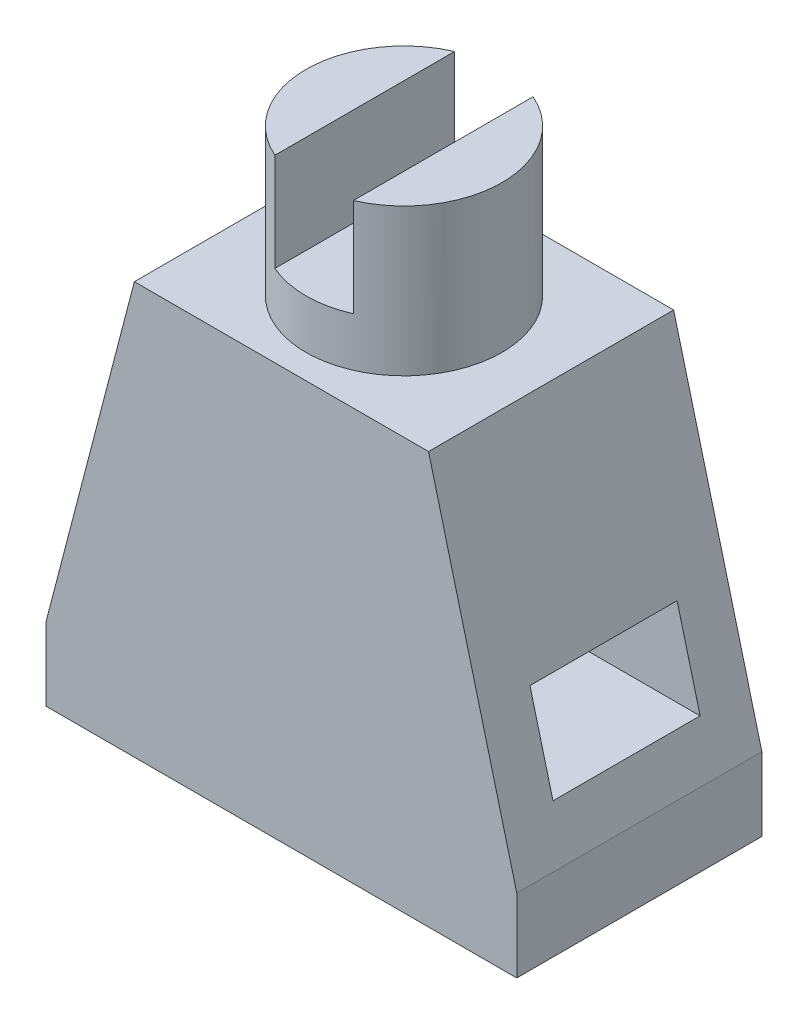
ISO-10303-21;
HEADER;
FILE_DESCRIPTION(('STEP AP214'),'2;1');
FILE_NAME('part.step','',(''),(''),'','','');
FILE_SCHEMA(('AUTOMOTIVE_DESIGN { 1 0 10303 214 1 1 1 1 }'));
ENDSEC;
DATA;
#1=APPLICATION_CONTEXT('core data for automotive mechanical design processes');
#2=APPLICATION_PROTOCOL_DEFINITION('international standard','automotive_design',2000,#1);
#3=PRODUCT_CONTEXT('',#1,'mechanical');
#4=PRODUCT('Part','Part','',(#3));
#5=PRODUCT_RELATED_PRODUCT_CATEGORY('part','',(#4));
#6=PRODUCT_DEFINITION_FORMATION('','',#4);
#7=PRODUCT_DEFINITION_CONTEXT('part definition',#1,'design');
#8=PRODUCT_DEFINITION('design','',#6,#7);
#9=PRODUCT_DEFINITION_SHAPE('','',#8);
#10=(LENGTH_UNIT() NAMED_UNIT(*) SI_UNIT(.MILLI.,.METRE.));
#11=(NAMED_UNIT(*) PLANE_ANGLE_UNIT() SI_UNIT($,.RADIAN.));
#12=(NAMED_UNIT(*) SI_UNIT($,.STERADIAN.) SOLID_ANGLE_UNIT());
#13=UNCERTAINTY_MEASURE_WITH_UNIT(LENGTH_MEASURE(1.E-05),#10,'distance_accuracy_value','');
#14=(GEOMETRIC_REPRESENTATION_CONTEXT(3) GLOBAL_UNCERTAINTY_ASSIGNED_CONTEXT((#13)) GLOBAL_UNIT_ASSIGNED_CONTEXT((#10,
#11,#12)) REPRESENTATION_CONTEXT('',''));
#15=CARTESIAN_POINT('',(0.,0.,0.));
#16=DIRECTION('',(0.,0.,1.));
#17=DIRECTION('',(1.,0.,0.));
#18=AXIS2_PLACEMENT_3D('',#15,#16,#17);
#19=CARTESIAN_POINT('',(48.,114.,-25.));
#20=DIRECTION('',(0.,1.,0.));
#21=DIRECTION('',(0.,0.,1.));
#22=AXIS2_PLACEMENT_3D('',#19,#20,#21);
#23=PLANE('',#22);
#24=DIRECTION('',(0.,0.,1.));
#25=VECTOR('',#24,1.);
#26=CARTESIAN_POINT('',(40.,114.,-6.66969722017663));
#27=LINE('',#26,#25);
#28=CARTESIAN_POINT('',(40.,114.,-43.3303027798234));
#29=VERTEX_POINT('',#28);
#30=CARTESIAN_POINT('',(40.,114.,-6.66969722017663));
#31=VERTEX_POINT('',#30);
#32=EDGE_CURVE('E149',#29,#31,#27,.T.);
#33=ORIENTED_EDGE('',*,*,#32,.F.);
#34=CARTESIAN_POINT('',(48.,114.,-25.));
#35=DIRECTION('',(0.,1.,0.));
#36=DIRECTION('',(0.,0.,1.));
#37=AXIS2_PLACEMENT_3D('',#34,#35,#36);
#38=CIRCLE('',#37,20.);
#39=EDGE_CURVE('E165',#29,#31,#38,.T.);
#40=ORIENTED_EDGE('',*,*,#39,.T.);
#41=EDGE_LOOP('',(#33,#40));
#42=FACE_BOUND('',#41,.T.);
#43=ADVANCED_FACE('F33',(#42),#23,.T.);
#44=CARTESIAN_POINT('',(0.,84.,0.));
#45=DIRECTION('',(0.,-1.,0.));
#46=DIRECTION('',(0.,0.,-1.));
#47=AXIS2_PLACEMENT_3D('',#44,#45,#46);
#48=PLANE('',#47);
#49=DIRECTION('',(1.,0.,0.));
#50=VECTOR('',#49,1.);
#51=CARTESIAN_POINT('',(0.,84.,0.));
#52=LINE('',#51,#50);
#53=CARTESIAN_POINT('',(18.,84.,0.));
#54=VERTEX_POINT('',#53);
#55=CARTESIAN_POINT('',(78.,84.,0.));
#56=VERTEX_POINT('',#55);
#57=EDGE_CURVE('E212',#54,#56,#52,.T.);
#58=ORIENTED_EDGE('',*,*,#57,.T.);
#59=DIRECTION('',(0.,0.,-1.));
#60=VECTOR('',#59,1.);
#61=CARTESIAN_POINT('',(78.,84.,233.76368558454));
#62=LINE('',#61,#60);
#63=CARTESIAN_POINT('',(78.,84.,-50.));
#64=VERTEX_POINT('',#63);
#65=EDGE_CURVE('E164',#56,#64,#62,.T.);
#66=ORIENTED_EDGE('',*,*,#65,.T.);
#67=DIRECTION('',(-1.,0.,0.));
#68=VECTOR('',#67,1.);
#69=CARTESIAN_POINT('',(0.,84.,-50.));
#70=LINE('',#69,#68);
#71=CARTESIAN_POINT('',(18.,84.,-50.));
#72=VERTEX_POINT('',#71);
#73=EDGE_CURVE('E215',#64,#72,#70,.T.);
#74=ORIENTED_EDGE('',*,*,#73,.T.);
#75=DIRECTION('',(0.,0.,-1.));
#76=VECTOR('',#75,1.);
#77=CARTESIAN_POINT('',(18.,84.,171.26368558454));
#78=LINE('',#77,#76);
#79=EDGE_CURVE('E184',#54,#72,#78,.T.);
#80=ORIENTED_EDGE('',*,*,#79,.F.);
#81=EDGE_LOOP('',(#58,#66,#74,#80));
#82=FACE_BOUND('',#81,.T.);
#83=CARTESIAN_POINT('',(48.,84.,-25.));
#84=DIRECTION('',(0.,-1.,0.));
#85=DIRECTION('',(0.,0.,-1.));
#86=AXIS2_PLACEMENT_3D('',#83,#84,#85);
#87=CIRCLE('',#86,20.);
#88=CARTESIAN_POINT('',(48.,84.,-45.));
#89=VERTEX_POINT('',#88);
#90=EDGE_CURVE('E11',#89,#89,#87,.F.);
#91=ORIENTED_EDGE('',*,*,#90,.F.);
#92=EDGE_LOOP('',(#91));
#93=FACE_BOUND('',#92,.T.);
#94=ADVANCED_FACE('F261',(#82,#93),#48,.F.);
#95=CARTESIAN_POINT('',(0.,84.,0.));
#96=DIRECTION('',(1.,0.,0.));
#97=DIRECTION('',(0.,0.,-1.));
#98=AXIS2_PLACEMENT_3D('',#95,#96,#97);
#99=PLANE('',#98);
#100=DIRECTION('',(0.,0.,-1.));
#101=VECTOR('',#100,1.);
#102=CARTESIAN_POINT('',(0.,15.,171.26368558454));
#103=LINE('',#102,#101);
#104=CARTESIAN_POINT('',(0.,15.,0.));
#105=VERTEX_POINT('',#104);
#106=CARTESIAN_POINT('',(0.,15.,-50.));
#107=VERTEX_POINT('',#106);
#108=EDGE_CURVE('E183',#105,#107,#103,.T.);
#109=ORIENTED_EDGE('',*,*,#108,.T.);
#110=DIRECTION('',(0.,-1.,0.));
#111=VECTOR('',#110,1.);
#112=CARTESIAN_POINT('',(0.,84.,-50.));
#113=LINE('',#112,#111);
#114=CARTESIAN_POINT('',(0.,0.,-50.));
#115=VERTEX_POINT('',#114);
#116=EDGE_CURVE('E218',#107,#115,#113,.T.);
#117=ORIENTED_EDGE('',*,*,#116,.T.);
#118=DIRECTION('',(0.,0.,1.));
#119=VECTOR('',#118,1.);
#120=CARTESIAN_POINT('',(0.,0.,0.));
#121=LINE('',#120,#119);
#122=CARTESIAN_POINT('',(0.,0.,0.));
#123=VERTEX_POINT('',#122);
#124=EDGE_CURVE('E206',#115,#123,#121,.T.);
#125=ORIENTED_EDGE('',*,*,#124,.T.);
#126=DIRECTION('',(0.,-1.,0.));
#127=VECTOR('',#126,1.);
#128=CARTESIAN_POINT('',(0.,84.,0.));
#129=LINE('',#128,#127);
#130=EDGE_CURVE('E234',#105,#123,#129,.T.);
#131=ORIENTED_EDGE('',*,*,#130,.F.);
#132=EDGE_LOOP('',(#109,#117,#125,#131));
#133=FACE_BOUND('',#132,.T.);
#134=ADVANCED_FACE('F35',(#133),#99,.F.);
#135=CARTESIAN_POINT('',(0.,84.,0.));
#136=DIRECTION('',(0.,0.,-1.));
#137=DIRECTION('',(-1.,0.,0.));
#138=AXIS2_PLACEMENT_3D('',#135,#136,#137);
#139=PLANE('',#138);
#140=DIRECTION('',(0.,-1.,0.));
#141=VECTOR('',#140,1.);
#142=CARTESIAN_POINT('',(96.,84.,0.));
#143=LINE('',#142,#141);
#144=CARTESIAN_POINT('',(96.,15.,0.));
#145=VERTEX_POINT('',#144);
#146=CARTESIAN_POINT('',(96.,0.,0.));
#147=VERTEX_POINT('',#146);
#148=EDGE_CURVE('E232',#145,#147,#143,.T.);
#149=ORIENTED_EDGE('',*,*,#148,.F.);
#150=DIRECTION('',(-0.252421897147003,0.967617272396844,0.));
#151=VECTOR('',#150,1.);
#152=CARTESIAN_POINT('',(73.0300884955752,103.051327433628,0.));
#153=LINE('',#152,#151);
#154=EDGE_CURVE('E180',#145,#56,#153,.T.);
#155=ORIENTED_EDGE('',*,*,#154,.T.);
#156=ORIENTED_EDGE('',*,*,#57,.F.);
#157=DIRECTION('',(0.252421897147003,0.967617272396844,0.));
#158=VECTOR('',#157,1.);
#159=CARTESIAN_POINT('',(16.8530973451327,79.6035398230089,0.));
#160=LINE('',#159,#158);
#161=EDGE_CURVE('E200',#105,#54,#160,.T.);
#162=ORIENTED_EDGE('',*,*,#161,.F.);
#163=ORIENTED_EDGE('',*,*,#130,.T.);
#164=DIRECTION('',(1.,0.,0.));
#165=VECTOR('',#164,1.);
#166=CARTESIAN_POINT('',(0.,0.,0.));
#167=LINE('',#166,#165);
#168=EDGE_CURVE('E221',#123,#147,#167,.T.);
#169=ORIENTED_EDGE('',*,*,#168,.T.);
#170=EDGE_LOOP('',(#149,#155,#156,#162,#163,#169));
#171=FACE_BOUND('',#170,.T.);
#172=ADVANCED_FACE('F245',(#171),#139,.F.);
#173=CARTESIAN_POINT('',(0.,84.,-50.));
#174=DIRECTION('',(0.,0.,1.));
#175=DIRECTION('',(1.,0.,0.));
#176=AXIS2_PLACEMENT_3D('',#173,#174,#175);
#177=PLANE('',#176);
#178=ORIENTED_EDGE('',*,*,#73,.F.);
#179=DIRECTION('',(0.252421897147003,-0.967617272396844,0.));
#180=VECTOR('',#179,1.);
#181=CARTESIAN_POINT('',(73.0300884955752,103.051327433628,-50.));
#182=LINE('',#181,#180);
#183=CARTESIAN_POINT('',(96.,15.,-50.));
#184=VERTEX_POINT('',#183);
#185=EDGE_CURVE('E177',#64,#184,#182,.T.);
#186=ORIENTED_EDGE('',*,*,#185,.T.);
#187=DIRECTION('',(0.,-1.,0.));
#188=VECTOR('',#187,1.);
#189=CARTESIAN_POINT('',(96.,84.,-50.));
#190=LINE('',#189,#188);
#191=CARTESIAN_POINT('',(96.,0.,-50.));
#192=VERTEX_POINT('',#191);
#193=EDGE_CURVE('E230',#184,#192,#190,.T.);
#194=ORIENTED_EDGE('',*,*,#193,.T.);
#195=DIRECTION('',(-1.,0.,0.));
#196=VECTOR('',#195,1.);
#197=CARTESIAN_POINT('',(0.,0.,-50.));
#198=LINE('',#197,#196);
#199=EDGE_CURVE('E216',#192,#115,#198,.T.);
#200=ORIENTED_EDGE('',*,*,#199,.T.);
#201=ORIENTED_EDGE('',*,*,#116,.F.);
#202=DIRECTION('',(-0.252421897147003,-0.967617272396844,0.));
#203=VECTOR('',#202,1.);
#204=CARTESIAN_POINT('',(16.8530973451327,79.6035398230089,-50.));
#205=LINE('',#204,#203);
#206=EDGE_CURVE('E197',#72,#107,#205,.T.);
#207=ORIENTED_EDGE('',*,*,#206,.F.);
#208=EDGE_LOOP('',(#178,#186,#194,#200,#201,#207));
#209=FACE_BOUND('',#208,.T.);
#210=ADVANCED_FACE('F257',(#209),#177,.F.);
#211=CARTESIAN_POINT('',(102.,25.,-40.));
#212=DIRECTION('',(0.,0.,-1.));
#213=DIRECTION('',(-1.,0.,0.));
#214=AXIS2_PLACEMENT_3D('',#211,#212,#213);
#215=PLANE('',#214);
#216=DIRECTION('',(-1.,0.,0.));
#217=VECTOR('',#216,1.);
#218=CARTESIAN_POINT('',(102.,25.,-40.));
#219=LINE('',#218,#217);
#220=CARTESIAN_POINT('',(93.3913043478261,25.,-40.));
#221=VERTEX_POINT('',#220);
#222=CARTESIAN_POINT('',(2.60869565217391,25.,-40.));
#223=VERTEX_POINT('',#222);
#224=EDGE_CURVE('E203',#221,#223,#219,.T.);
#225=ORIENTED_EDGE('',*,*,#224,.F.);
#226=DIRECTION('',(-0.252421897147003,0.967617272396844,0.));
#227=VECTOR('',#226,1.);
#228=CARTESIAN_POINT('',(93.9398230088496,22.8973451327434,-40.));
#229=LINE('',#228,#227);
#230=CARTESIAN_POINT('',(88.695652173913,43.,-40.));
#231=VERTEX_POINT('',#230);
#232=EDGE_CURVE('E56',#221,#231,#229,.T.);
#233=ORIENTED_EDGE('',*,*,#232,.T.);
#234=DIRECTION('',(-1.,0.,0.));
#235=VECTOR('',#234,1.);
#236=CARTESIAN_POINT('',(102.,43.,-40.));
#237=LINE('',#236,#235);
#238=CARTESIAN_POINT('',(7.30434782608698,43.,-40.));
#239=VERTEX_POINT('',#238);
#240=EDGE_CURVE('E204',#231,#239,#237,.T.);
#241=ORIENTED_EDGE('',*,*,#240,.T.);
#242=DIRECTION('',(0.252421897147003,0.967617272396844,0.));
#243=VECTOR('',#242,1.);
#244=CARTESIAN_POINT('',(8.94159292035396,49.2761061946903,-40.));
#245=LINE('',#244,#243);
#246=EDGE_CURVE('E194',#223,#239,#245,.T.);
#247=ORIENTED_EDGE('',*,*,#246,.F.);
#248=EDGE_LOOP('',(#225,#233,#241,#247));
#249=FACE_BOUND('',#248,.T.);
#250=ADVANCED_FACE('F311',(#249),#215,.F.);
#251=CARTESIAN_POINT('',(102.,43.,-40.));
#252=DIRECTION('',(0.,1.,0.));
#253=DIRECTION('',(0.,0.,1.));
#254=AXIS2_PLACEMENT_3D('',#251,#252,#253);
#255=PLANE('',#254);
#256=ORIENTED_EDGE('',*,*,#240,.F.);
#257=DIRECTION('',(0.,0.,1.));
#258=VECTOR('',#257,1.);
#259=CARTESIAN_POINT('',(88.695652173913,43.,-40.));
#260=LINE('',#259,#258);
#261=CARTESIAN_POINT('',(88.695652173913,43.,-10.));
#262=VERTEX_POINT('',#261);
#263=EDGE_CURVE('E173',#231,#262,#260,.T.);
#264=ORIENTED_EDGE('',*,*,#263,.T.);
#265=DIRECTION('',(-1.,0.,0.));
#266=VECTOR('',#265,1.);
#267=CARTESIAN_POINT('',(102.,43.,-10.));
#268=LINE('',#267,#266);
#269=CARTESIAN_POINT('',(7.30434782608693,43.,-10.));
#270=VERTEX_POINT('',#269);
#271=EDGE_CURVE('E207',#262,#270,#268,.T.);
#272=ORIENTED_EDGE('',*,*,#271,.T.);
#273=DIRECTION('',(0.,0.,1.));
#274=VECTOR('',#273,1.);
#275=CARTESIAN_POINT('',(7.30434782608695,43.,-40.));
#276=LINE('',#275,#274);
#277=EDGE_CURVE('E191',#239,#270,#276,.T.);
#278=ORIENTED_EDGE('',*,*,#277,.F.);
#279=EDGE_LOOP('',(#256,#264,#272,#278));
#280=FACE_BOUND('',#279,.T.);
#281=ADVANCED_FACE('F307',(#280),#255,.F.);
#282=CARTESIAN_POINT('',(102.,25.,-10.));
#283=DIRECTION('',(0.,0.,1.));
#284=DIRECTION('',(1.,0.,0.));
#285=AXIS2_PLACEMENT_3D('',#282,#283,#284);
#286=PLANE('',#285);
#287=ORIENTED_EDGE('',*,*,#271,.F.);
#288=DIRECTION('',(0.252421897147003,-0.967617272396844,0.));
#289=VECTOR('',#288,1.);
#290=CARTESIAN_POINT('',(93.9398230088496,22.8973451327434,-10.));
#291=LINE('',#290,#289);
#292=CARTESIAN_POINT('',(93.3913043478261,25.,-10.));
#293=VERTEX_POINT('',#292);
#294=EDGE_CURVE('E170',#262,#293,#291,.T.);
#295=ORIENTED_EDGE('',*,*,#294,.T.);
#296=DIRECTION('',(-1.,0.,0.));
#297=VECTOR('',#296,1.);
#298=CARTESIAN_POINT('',(102.,25.,-10.));
#299=LINE('',#298,#297);
#300=CARTESIAN_POINT('',(2.60869565217393,25.,-10.));
#301=VERTEX_POINT('',#300);
#302=EDGE_CURVE('E209',#293,#301,#299,.T.);
#303=ORIENTED_EDGE('',*,*,#302,.T.);
#304=DIRECTION('',(-0.252421897147003,-0.967617272396844,0.));
#305=VECTOR('',#304,1.);
#306=CARTESIAN_POINT('',(8.94159292035396,49.2761061946903,-10.));
#307=LINE('',#306,#305);
#308=EDGE_CURVE('E187',#270,#301,#307,.T.);
#309=ORIENTED_EDGE('',*,*,#308,.F.);
#310=EDGE_LOOP('',(#287,#295,#303,#309));
#311=FACE_BOUND('',#310,.T.);
#312=ADVANCED_FACE('F310',(#311),#286,.F.);
#313=CARTESIAN_POINT('',(102.,25.,-40.));
#314=DIRECTION('',(0.,-1.,0.));
#315=DIRECTION('',(0.,0.,-1.));
#316=AXIS2_PLACEMENT_3D('',#313,#314,#315);
#317=PLANE('',#316);
#318=ORIENTED_EDGE('',*,*,#302,.F.);
#319=DIRECTION('',(0.,0.,-1.));
#320=VECTOR('',#319,1.);
#321=CARTESIAN_POINT('',(93.3913043478261,25.,-40.));
#322=LINE('',#321,#320);
#323=EDGE_CURVE('E168',#293,#221,#322,.T.);
#324=ORIENTED_EDGE('',*,*,#323,.T.);
#325=ORIENTED_EDGE('',*,*,#224,.T.);
#326=DIRECTION('',(0.,0.,-1.));
#327=VECTOR('',#326,1.);
#328=CARTESIAN_POINT('',(2.60869565217391,25.,-40.));
#329=LINE('',#328,#327);
#330=EDGE_CURVE('E236',#301,#223,#329,.T.);
#331=ORIENTED_EDGE('',*,*,#330,.F.);
#332=EDGE_LOOP('',(#318,#324,#325,#331));
#333=FACE_BOUND('',#332,.T.);
#334=ADVANCED_FACE('F315',(#333),#317,.F.);
#335=CARTESIAN_POINT('',(96.,84.,0.));
#336=DIRECTION('',(-1.,0.,0.));
#337=DIRECTION('',(0.,0.,1.));
#338=AXIS2_PLACEMENT_3D('',#335,#336,#337);
#339=PLANE('',#338);
#340=ORIENTED_EDGE('',*,*,#193,.F.);
#341=DIRECTION('',(0.,0.,1.));
#342=VECTOR('',#341,1.);
#343=CARTESIAN_POINT('',(96.,15.,0.));
#344=LINE('',#343,#342);
#345=EDGE_CURVE('E41',#184,#145,#344,.T.);
#346=ORIENTED_EDGE('',*,*,#345,.T.);
#347=ORIENTED_EDGE('',*,*,#148,.T.);
#348=DIRECTION('',(0.,0.,-1.));
#349=VECTOR('',#348,1.);
#350=CARTESIAN_POINT('',(96.,0.,0.));
#351=LINE('',#350,#349);
#352=EDGE_CURVE('E224',#147,#192,#351,.T.);
#353=ORIENTED_EDGE('',*,*,#352,.T.);
#354=EDGE_LOOP('',(#340,#346,#347,#353));
#355=FACE_BOUND('',#354,.T.);
#356=ADVANCED_FACE('F242',(#355),#339,.F.);
#357=CARTESIAN_POINT('',(0.,0.,0.));
#358=DIRECTION('',(0.,-1.,0.));
#359=DIRECTION('',(0.,0.,-1.));
#360=AXIS2_PLACEMENT_3D('',#357,#358,#359);
#361=PLANE('',#360);
#362=ORIENTED_EDGE('',*,*,#124,.F.);
#363=ORIENTED_EDGE('',*,*,#199,.F.);
#364=ORIENTED_EDGE('',*,*,#352,.F.);
#365=ORIENTED_EDGE('',*,*,#168,.F.);
#366=EDGE_LOOP('',(#362,#363,#364,#365));
#367=FACE_BOUND('',#366,.T.);
#368=ADVANCED_FACE('F253',(#367),#361,.T.);
#369=CARTESIAN_POINT('',(0.,15.,171.26368558454));
#370=DIRECTION('',(-0.967617272396844,0.252421897147003,0.));
#371=DIRECTION('',(-0.252421897147003,-0.967617272396844,0.));
#372=AXIS2_PLACEMENT_3D('',#369,#370,#371);
#373=PLANE('',#372);
#374=ORIENTED_EDGE('',*,*,#330,.T.);
#375=ORIENTED_EDGE('',*,*,#246,.T.);
#376=ORIENTED_EDGE('',*,*,#277,.T.);
#377=ORIENTED_EDGE('',*,*,#308,.T.);
#378=EDGE_LOOP('',(#374,#375,#376,#377));
#379=FACE_BOUND('',#378,.T.);
#380=ORIENTED_EDGE('',*,*,#108,.F.);
#381=ORIENTED_EDGE('',*,*,#161,.T.);
#382=ORIENTED_EDGE('',*,*,#79,.T.);
#383=ORIENTED_EDGE('',*,*,#206,.T.);
#384=EDGE_LOOP('',(#380,#381,#382,#383));
#385=FACE_BOUND('',#384,.T.);
#386=ADVANCED_FACE('F265',(#379,#385),#373,.T.);
#387=CARTESIAN_POINT('',(96.,15.,233.76368558454));
#388=DIRECTION('',(-0.967617272396844,-0.252421897147003,0.));
#389=DIRECTION('',(0.252421897147003,-0.967617272396844,0.));
#390=AXIS2_PLACEMENT_3D('',#387,#388,#389);
#391=PLANE('',#390);
#392=ORIENTED_EDGE('',*,*,#232,.F.);
#393=ORIENTED_EDGE('',*,*,#323,.F.);
#394=ORIENTED_EDGE('',*,*,#294,.F.);
#395=ORIENTED_EDGE('',*,*,#263,.F.);
#396=EDGE_LOOP('',(#392,#393,#394,#395));
#397=FACE_BOUND('',#396,.T.);
#398=ORIENTED_EDGE('',*,*,#154,.F.);
#399=ORIENTED_EDGE('',*,*,#345,.F.);
#400=ORIENTED_EDGE('',*,*,#185,.F.);
#401=ORIENTED_EDGE('',*,*,#65,.F.);
#402=EDGE_LOOP('',(#398,#399,#400,#401));
#403=FACE_BOUND('',#402,.T.);
#404=ADVANCED_FACE('F259',(#397,#403),#391,.F.);
#405=CARTESIAN_POINT('',(48.,114.,-25.));
#406=DIRECTION('',(0.,-1.,0.));
#407=DIRECTION('',(0.,0.,-1.));
#408=AXIS2_PLACEMENT_3D('',#405,#406,#407);
#409=CYLINDRICAL_SURFACE('',#408,20.);
#410=ORIENTED_EDGE('',*,*,#39,.F.);
#411=DIRECTION('',(0.,1.,0.));
#412=VECTOR('',#411,1.);
#413=CARTESIAN_POINT('',(40.,94.,-43.3303027798234));
#414=LINE('',#413,#412);
#415=CARTESIAN_POINT('',(40.,94.,-43.3303027798234));
#416=VERTEX_POINT('',#415);
#417=EDGE_CURVE('E158',#416,#29,#414,.T.);
#418=ORIENTED_EDGE('',*,*,#417,.F.);
#419=CARTESIAN_POINT('',(48.,94.,-25.));
#420=DIRECTION('',(0.,1.,0.));
#421=DIRECTION('',(0.,0.,1.));
#422=AXIS2_PLACEMENT_3D('',#419,#420,#421);
#423=CIRCLE('',#422,20.);
#424=CARTESIAN_POINT('',(56.,94.,-43.3303027798234));
#425=VERTEX_POINT('',#424);
#426=EDGE_CURVE('E139',#425,#416,#423,.T.);
#427=ORIENTED_EDGE('',*,*,#426,.F.);
#428=DIRECTION('',(0.,1.,0.));
#429=VECTOR('',#428,1.);
#430=CARTESIAN_POINT('',(56.,94.,-43.3303027798234));
#431=LINE('',#430,#429);
#432=CARTESIAN_POINT('',(56.,114.,-43.3303027798234));
#433=VERTEX_POINT('',#432);
#434=EDGE_CURVE('E136',#425,#433,#431,.T.);
#435=ORIENTED_EDGE('',*,*,#434,.T.);
#436=CARTESIAN_POINT('',(56.,114.,-6.66969722017663));
#437=VERTEX_POINT('',#436);
#438=EDGE_CURVE('E156',#437,#433,#38,.T.);
#439=ORIENTED_EDGE('',*,*,#438,.F.);
#440=DIRECTION('',(0.,1.,0.));
#441=VECTOR('',#440,1.);
#442=CARTESIAN_POINT('',(56.,94.,-6.66969722017663));
#443=LINE('',#442,#441);
#444=CARTESIAN_POINT('',(56.,94.,-6.66969722017663));
#445=VERTEX_POINT('',#444);
#446=EDGE_CURVE('E48',#445,#437,#443,.T.);
#447=ORIENTED_EDGE('',*,*,#446,.F.);
#448=CARTESIAN_POINT('',(48.,94.,-25.));
#449=DIRECTION('',(0.,1.,0.));
#450=DIRECTION('',(0.,0.,1.));
#451=AXIS2_PLACEMENT_3D('',#448,#449,#450);
#452=CIRCLE('',#451,20.);
#453=CARTESIAN_POINT('',(40.,94.,-6.66969722017663));
#454=VERTEX_POINT('',#453);
#455=EDGE_CURVE('E140',#454,#445,#452,.T.);
#456=ORIENTED_EDGE('',*,*,#455,.F.);
#457=DIRECTION('',(0.,1.,0.));
#458=VECTOR('',#457,1.);
#459=CARTESIAN_POINT('',(40.,94.,-6.66969722017663));
#460=LINE('',#459,#458);
#461=EDGE_CURVE('E296',#454,#31,#460,.T.);
#462=ORIENTED_EDGE('',*,*,#461,.T.);
#463=EDGE_LOOP('',(#410,#418,#427,#435,#439,#447,#456,#462));
#464=FACE_BOUND('',#463,.T.);
#465=ORIENTED_EDGE('',*,*,#90,.T.);
#466=EDGE_LOOP('',(#465));
#467=FACE_BOUND('',#466,.T.);
#468=ADVANCED_FACE('F153',(#464,#467),#409,.T.);
#469=DIRECTION('',(0.,0.,-1.));
#470=VECTOR('',#469,1.);
#471=CARTESIAN_POINT('',(56.,114.,-6.66969722017663));
#472=LINE('',#471,#470);
#473=EDGE_CURVE('E291',#437,#433,#472,.T.);
#474=ORIENTED_EDGE('',*,*,#473,.F.);
#475=ORIENTED_EDGE('',*,*,#438,.T.);
#476=EDGE_LOOP('',(#474,#475));
#477=FACE_BOUND('',#476,.T.);
#478=ADVANCED_FACE('F276',(#477),#23,.T.);
#479=CARTESIAN_POINT('',(40.,94.,-6.66969722017663));
#480=DIRECTION('',(-1.,0.,0.));
#481=DIRECTION('',(0.,0.,1.));
#482=AXIS2_PLACEMENT_3D('',#479,#480,#481);
#483=PLANE('',#482);
#484=ORIENTED_EDGE('',*,*,#32,.T.);
#485=ORIENTED_EDGE('',*,*,#461,.F.);
#486=DIRECTION('',(0.,0.,1.));
#487=VECTOR('',#486,1.);
#488=CARTESIAN_POINT('',(40.,94.,-6.66969722017663));
#489=LINE('',#488,#487);
#490=EDGE_CURVE('E146',#416,#454,#489,.T.);
#491=ORIENTED_EDGE('',*,*,#490,.F.);
#492=ORIENTED_EDGE('',*,*,#417,.T.);
#493=EDGE_LOOP('',(#484,#485,#491,#492));
#494=FACE_BOUND('',#493,.T.);
#495=ADVANCED_FACE('F283',(#494),#483,.F.);
#496=CARTESIAN_POINT('',(56.,94.,-6.66969722017663));
#497=DIRECTION('',(1.,0.,0.));
#498=DIRECTION('',(0.,0.,-1.));
#499=AXIS2_PLACEMENT_3D('',#496,#497,#498);
#500=PLANE('',#499);
#501=ORIENTED_EDGE('',*,*,#473,.T.);
#502=ORIENTED_EDGE('',*,*,#434,.F.);
#503=DIRECTION('',(0.,0.,-1.));
#504=VECTOR('',#503,1.);
#505=CARTESIAN_POINT('',(56.,94.,-6.66969722017663));
#506=LINE('',#505,#504);
#507=EDGE_CURVE('E132',#445,#425,#506,.T.);
#508=ORIENTED_EDGE('',*,*,#507,.F.);
#509=ORIENTED_EDGE('',*,*,#446,.T.);
#510=EDGE_LOOP('',(#501,#502,#508,#509));
#511=FACE_BOUND('',#510,.T.);
#512=ADVANCED_FACE('F134',(#511),#500,.F.);
#513=CARTESIAN_POINT('',(48.,94.,-25.));
#514=DIRECTION('',(0.,1.,0.));
#515=DIRECTION('',(0.,0.,1.));
#516=AXIS2_PLACEMENT_3D('',#513,#514,#515);
#517=PLANE('',#516);
#518=ORIENTED_EDGE('',*,*,#455,.T.);
#519=ORIENTED_EDGE('',*,*,#507,.T.);
#520=ORIENTED_EDGE('',*,*,#426,.T.);
#521=ORIENTED_EDGE('',*,*,#490,.T.);
#522=EDGE_LOOP('',(#518,#519,#520,#521));
#523=FACE_BOUND('',#522,.T.);
#524=ADVANCED_FACE('F144',(#523),#517,.T.);
#525=CLOSED_SHELL('',(#43,#94,#134,#172,#210,#250,#281,#312,#334,#356,#368,#386,#404,#468,#478,
#495,#512,#524));
#526=MANIFOLD_SOLID_BREP('B2',#525);
#527=ADVANCED_BREP_SHAPE_REPRESENTATION('',(#18,#526),#14);
#528=SHAPE_DEFINITION_REPRESENTATION(#9,#527);
ENDSEC;
END-ISO-10303-21;
